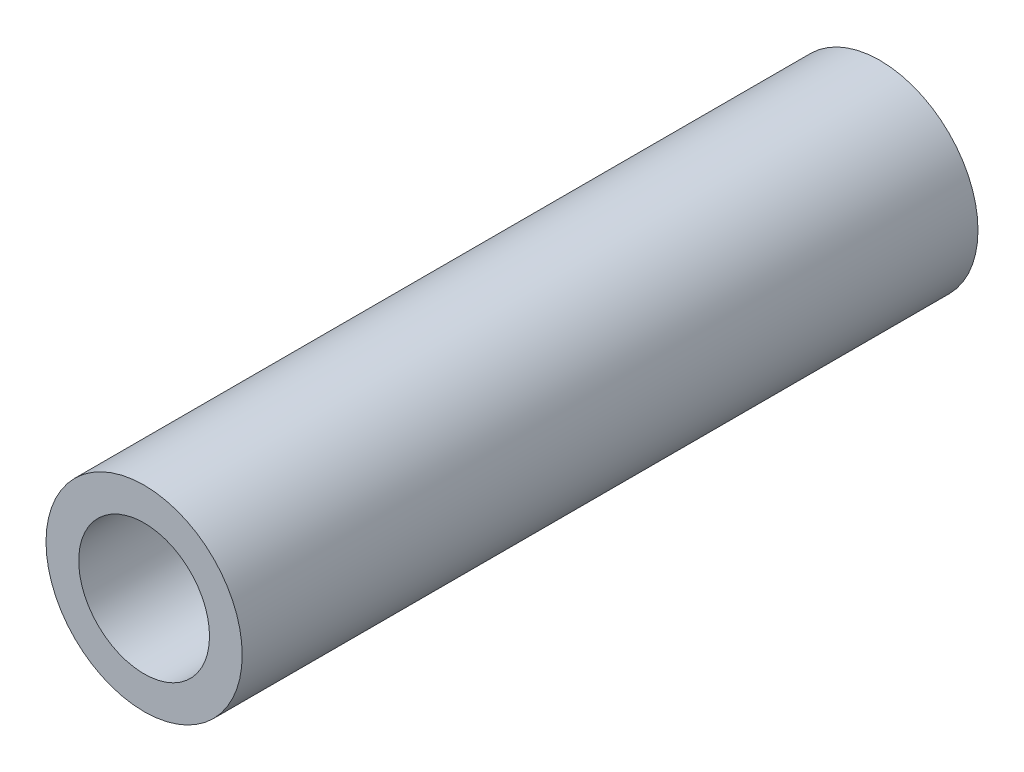
ISO-10303-21;
HEADER;
FILE_DESCRIPTION(('STEP AP214'),'2;1');
FILE_NAME('part.step','',(''),(''),'','','');
FILE_SCHEMA(('AUTOMOTIVE_DESIGN { 1 0 10303 214 1 1 1 1 }'));
ENDSEC;
DATA;
#1=APPLICATION_CONTEXT('core data for automotive mechanical design processes');
#2=APPLICATION_PROTOCOL_DEFINITION('international standard','automotive_design',2000,#1);
#3=PRODUCT_CONTEXT('',#1,'mechanical');
#4=PRODUCT('Part','Part','',(#3));
#5=PRODUCT_RELATED_PRODUCT_CATEGORY('part','',(#4));
#6=PRODUCT_DEFINITION_FORMATION('','',#4);
#7=PRODUCT_DEFINITION_CONTEXT('part definition',#1,'design');
#8=PRODUCT_DEFINITION('design','',#6,#7);
#9=PRODUCT_DEFINITION_SHAPE('','',#8);
#10=(LENGTH_UNIT() NAMED_UNIT(*) SI_UNIT(.MILLI.,.METRE.));
#11=(NAMED_UNIT(*) PLANE_ANGLE_UNIT() SI_UNIT($,.RADIAN.));
#12=(NAMED_UNIT(*) SI_UNIT($,.STERADIAN.) SOLID_ANGLE_UNIT());
#13=UNCERTAINTY_MEASURE_WITH_UNIT(LENGTH_MEASURE(1.E-05),#10,'distance_accuracy_value','');
#14=(GEOMETRIC_REPRESENTATION_CONTEXT(3) GLOBAL_UNCERTAINTY_ASSIGNED_CONTEXT((#13)) GLOBAL_UNIT_ASSIGNED_CONTEXT((#10,
#11,#12)) REPRESENTATION_CONTEXT('',''));
#15=CARTESIAN_POINT('',(0.,0.,0.));
#16=DIRECTION('',(0.,0.,1.));
#17=DIRECTION('',(1.,0.,0.));
#18=AXIS2_PLACEMENT_3D('',#15,#16,#17);
#19=CARTESIAN_POINT('',(0.,0.,57.15));
#20=DIRECTION('',(0.,0.,1.));
#21=DIRECTION('',(1.,0.,0.));
#22=AXIS2_PLACEMENT_3D('',#19,#20,#21);
#23=PLANE('',#22);
#24=CARTESIAN_POINT('',(0.,0.,57.15));
#25=DIRECTION('',(0.,0.,1.));
#26=DIRECTION('',(1.,0.,0.));
#27=AXIS2_PLACEMENT_3D('',#24,#25,#26);
#28=CIRCLE('',#27,7.62);
#29=CARTESIAN_POINT('',(7.62,0.,57.15));
#30=VERTEX_POINT('',#29);
#31=EDGE_CURVE('E10',#30,#30,#28,.T.);
#32=ORIENTED_EDGE('',*,*,#31,.T.);
#33=EDGE_LOOP('',(#32));
#34=FACE_BOUND('',#33,.T.);
#35=CARTESIAN_POINT('',(0.,0.,57.15));
#36=DIRECTION('',(0.,0.,1.));
#37=DIRECTION('',(1.,0.,0.));
#38=AXIS2_PLACEMENT_3D('',#35,#36,#37);
#39=CIRCLE('',#38,5.08);
#40=CARTESIAN_POINT('',(5.08,0.,57.15));
#41=VERTEX_POINT('',#40);
#42=EDGE_CURVE('E43',#41,#41,#39,.T.);
#43=ORIENTED_EDGE('',*,*,#42,.F.);
#44=EDGE_LOOP('',(#43));
#45=FACE_BOUND('',#44,.T.);
#46=ADVANCED_FACE('F32',(#34,#45),#23,.T.);
#47=CARTESIAN_POINT('',(0.,0.,0.));
#48=DIRECTION('',(0.,0.,1.));
#49=DIRECTION('',(1.,0.,0.));
#50=AXIS2_PLACEMENT_3D('',#47,#48,#49);
#51=PLANE('',#50);
#52=CARTESIAN_POINT('',(0.,0.,0.));
#53=DIRECTION('',(0.,0.,1.));
#54=DIRECTION('',(1.,0.,0.));
#55=AXIS2_PLACEMENT_3D('',#52,#53,#54);
#56=CIRCLE('',#55,7.62);
#57=CARTESIAN_POINT('',(7.62,0.,0.));
#58=VERTEX_POINT('',#57);
#59=EDGE_CURVE('E36',#58,#58,#56,.T.);
#60=ORIENTED_EDGE('',*,*,#59,.F.);
#61=EDGE_LOOP('',(#60));
#62=FACE_BOUND('',#61,.T.);
#63=CARTESIAN_POINT('',(0.,0.,0.));
#64=DIRECTION('',(0.,0.,1.));
#65=DIRECTION('',(1.,0.,0.));
#66=AXIS2_PLACEMENT_3D('',#63,#64,#65);
#67=CIRCLE('',#66,5.08);
#68=CARTESIAN_POINT('',(5.08,0.,0.));
#69=VERTEX_POINT('',#68);
#70=EDGE_CURVE('E45',#69,#69,#67,.T.);
#71=ORIENTED_EDGE('',*,*,#70,.T.);
#72=EDGE_LOOP('',(#71));
#73=FACE_BOUND('',#72,.T.);
#74=ADVANCED_FACE('F55',(#62,#73),#51,.F.);
#75=CARTESIAN_POINT('',(0.,0.,57.15));
#76=DIRECTION('',(0.,0.,-1.));
#77=DIRECTION('',(-1.,0.,0.));
#78=AXIS2_PLACEMENT_3D('',#75,#76,#77);
#79=CYLINDRICAL_SURFACE('',#78,7.62);
#80=ORIENTED_EDGE('',*,*,#31,.F.);
#81=EDGE_LOOP('',(#80));
#82=FACE_BOUND('',#81,.T.);
#83=ORIENTED_EDGE('',*,*,#59,.T.);
#84=EDGE_LOOP('',(#83));
#85=FACE_BOUND('',#84,.T.);
#86=ADVANCED_FACE('F34',(#82,#85),#79,.T.);
#87=CARTESIAN_POINT('',(0.,0.,57.15));
#88=DIRECTION('',(0.,0.,-1.));
#89=DIRECTION('',(-1.,0.,0.));
#90=AXIS2_PLACEMENT_3D('',#87,#88,#89);
#91=CYLINDRICAL_SURFACE('',#90,5.08);
#92=ORIENTED_EDGE('',*,*,#42,.T.);
#93=EDGE_LOOP('',(#92));
#94=FACE_BOUND('',#93,.T.);
#95=ORIENTED_EDGE('',*,*,#70,.F.);
#96=EDGE_LOOP('',(#95));
#97=FACE_BOUND('',#96,.T.);
#98=ADVANCED_FACE('F51',(#94,#97),#91,.F.);
#99=CLOSED_SHELL('',(#46,#74,#86,#98));
#100=MANIFOLD_SOLID_BREP('B2',#99);
#101=ADVANCED_BREP_SHAPE_REPRESENTATION('',(#18,#100),#14);
#102=SHAPE_DEFINITION_REPRESENTATION(#9,#101);
ENDSEC;
END-ISO-10303-21;
